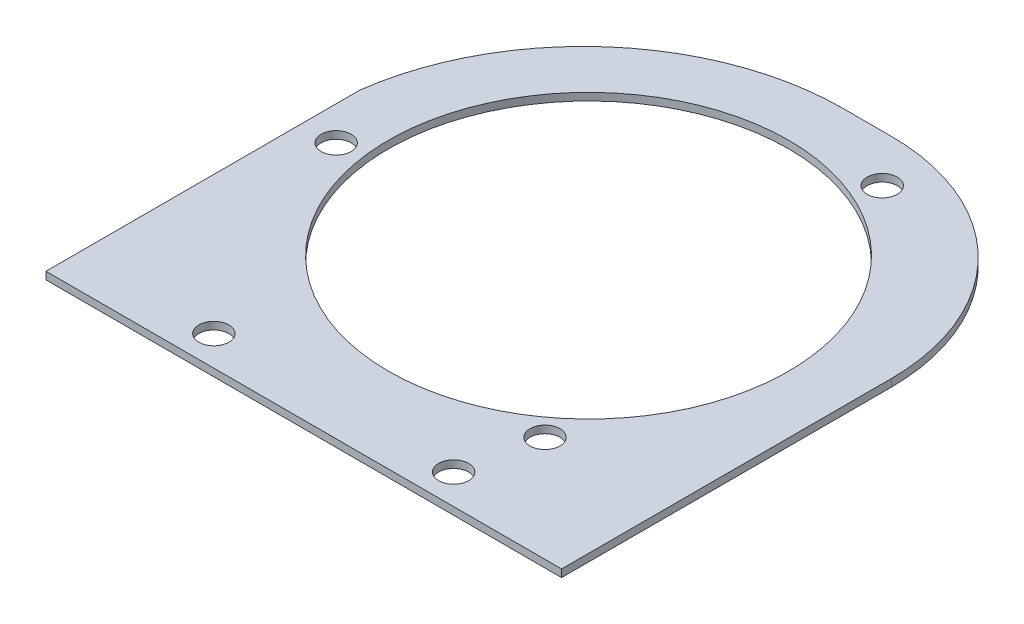
ISO-10303-21;
HEADER;
FILE_DESCRIPTION(('STEP AP214'),'2;1');
FILE_NAME('part.step','',(''),(''),'','','');
FILE_SCHEMA(('AUTOMOTIVE_DESIGN { 1 0 10303 214 1 1 1 1 }'));
ENDSEC;
DATA;
#1=APPLICATION_CONTEXT('core data for automotive mechanical design processes');
#2=APPLICATION_PROTOCOL_DEFINITION('international standard','automotive_design',2000,#1);
#3=PRODUCT_CONTEXT('',#1,'mechanical');
#4=PRODUCT('Part','Part','',(#3));
#5=PRODUCT_RELATED_PRODUCT_CATEGORY('part','',(#4));
#6=PRODUCT_DEFINITION_FORMATION('','',#4);
#7=PRODUCT_DEFINITION_CONTEXT('part definition',#1,'design');
#8=PRODUCT_DEFINITION('design','',#6,#7);
#9=PRODUCT_DEFINITION_SHAPE('','',#8);
#10=(LENGTH_UNIT() NAMED_UNIT(*) SI_UNIT(.MILLI.,.METRE.));
#11=(NAMED_UNIT(*) PLANE_ANGLE_UNIT() SI_UNIT($,.RADIAN.));
#12=(NAMED_UNIT(*) SI_UNIT($,.STERADIAN.) SOLID_ANGLE_UNIT());
#13=UNCERTAINTY_MEASURE_WITH_UNIT(LENGTH_MEASURE(1.E-05),#10,'distance_accuracy_value','');
#14=(GEOMETRIC_REPRESENTATION_CONTEXT(3) GLOBAL_UNCERTAINTY_ASSIGNED_CONTEXT((#13)) GLOBAL_UNIT_ASSIGNED_CONTEXT((#10,
#11,#12)) REPRESENTATION_CONTEXT('',''));
#15=CARTESIAN_POINT('',(0.,0.,0.));
#16=DIRECTION('',(0.,0.,1.));
#17=DIRECTION('',(1.,0.,0.));
#18=AXIS2_PLACEMENT_3D('',#15,#16,#17);
#19=CARTESIAN_POINT('',(16.7516707964213,3.175,-21.6657019962549));
#20=DIRECTION('',(0.,-1.,0.));
#21=DIRECTION('',(0.,0.,-1.));
#22=AXIS2_PLACEMENT_3D('',#19,#20,#21);
#23=PLANE('',#22);
#24=DIRECTION('',(0.,0.,1.));
#25=VECTOR('',#24,1.);
#26=CARTESIAN_POINT('',(-112.788329203579,3.175,-14.9421725844915));
#27=LINE('',#26,#25);
#28=CARTESIAN_POINT('',(-112.788329203579,3.175,-14.9421725844916));
#29=VERTEX_POINT('',#28);
#30=CARTESIAN_POINT('',(-112.788329203579,3.175,118.034298003745));
#31=VERTEX_POINT('',#30);
#32=EDGE_CURVE('E131',#29,#31,#27,.T.);
#33=ORIENTED_EDGE('',*,*,#32,.T.);
#34=DIRECTION('',(1.,0.,0.));
#35=VECTOR('',#34,1.);
#36=CARTESIAN_POINT('',(105.651670796421,3.175,118.034298003745));
#37=LINE('',#36,#35);
#38=CARTESIAN_POINT('',(105.651670796421,3.175,118.034298003745));
#39=VERTEX_POINT('',#38);
#40=EDGE_CURVE('E89',#31,#39,#37,.T.);
#41=ORIENTED_EDGE('',*,*,#40,.T.);
#42=DIRECTION('',(0.,0.,-1.));
#43=VECTOR('',#42,1.);
#44=CARTESIAN_POINT('',(105.651670796421,3.175,-21.6657019962549));
#45=LINE('',#44,#43);
#46=CARTESIAN_POINT('',(105.651670796421,3.175,-21.6657019962549));
#47=VERTEX_POINT('',#46);
#48=EDGE_CURVE('E102',#39,#47,#45,.T.);
#49=ORIENTED_EDGE('',*,*,#48,.T.);
#50=CARTESIAN_POINT('',(16.7516707964213,3.175,-21.6657019962549));
#51=DIRECTION('',(0.,1.,0.));
#52=DIRECTION('',(0.,0.,-1.));
#53=AXIS2_PLACEMENT_3D('',#50,#51,#52);
#54=CIRCLE('',#53,88.9);
#55=CARTESIAN_POINT('',(16.7516707964213,3.175,-110.565701996255));
#56=VERTEX_POINT('',#55);
#57=EDGE_CURVE('E96',#47,#56,#54,.T.);
#58=ORIENTED_EDGE('',*,*,#57,.T.);
#59=DIRECTION('',(-1.,0.,0.));
#60=VECTOR('',#59,1.);
#61=CARTESIAN_POINT('',(16.7516707964213,3.175,-110.565701996255));
#62=LINE('',#61,#60);
#63=CARTESIAN_POINT('',(-3.56832920357874,3.175,-110.565701996255));
#64=VERTEX_POINT('',#63);
#65=EDGE_CURVE('E100',#56,#64,#62,.T.);
#66=ORIENTED_EDGE('',*,*,#65,.T.);
#67=CARTESIAN_POINT('',(-3.56832920357873,3.175,-0.379077915372299));
#68=DIRECTION('',(0.,1.,0.));
#69=DIRECTION('',(0.,0.,1.));
#70=AXIS2_PLACEMENT_3D('',#67,#68,#69);
#71=CIRCLE('',#70,110.186624080883);
#72=EDGE_CURVE('E52',#64,#29,#71,.T.);
#73=ORIENTED_EDGE('',*,*,#72,.T.);
#74=EDGE_LOOP('',(#33,#41,#49,#58,#66,#73));
#75=FACE_BOUND('',#74,.T.);
#76=CARTESIAN_POINT('',(-3.56832920357873,3.175,-2.61570199625484));
#77=DIRECTION('',(0.,1.,0.));
#78=DIRECTION('',(0.,0.,1.));
#79=AXIS2_PLACEMENT_3D('',#76,#77,#78);
#80=CIRCLE('',#79,84.7725);
#81=CARTESIAN_POINT('',(-3.56832920357873,3.175,82.1567980037452));
#82=VERTEX_POINT('',#81);
#83=EDGE_CURVE('E124',#82,#82,#80,.T.);
#84=ORIENTED_EDGE('',*,*,#83,.F.);
#85=EDGE_LOOP('',(#84));
#86=FACE_BOUND('',#85,.T.);
#87=CARTESIAN_POINT('',(-98.4364962955683,3.175,9.45054506168119));
#88=DIRECTION('',(0.,1.,0.));
#89=DIRECTION('',(0.,0.,1.));
#90=AXIS2_PLACEMENT_3D('',#87,#88,#89);
#91=CIRCLE('',#90,6.35);
#92=CARTESIAN_POINT('',(-98.4364962955683,3.175,15.8005450616812));
#93=VERTEX_POINT('',#92);
#94=EDGE_CURVE('E215',#93,#93,#91,.T.);
#95=ORIENTED_EDGE('',*,*,#94,.F.);
#96=EDGE_LOOP('',(#95));
#97=FACE_BOUND('',#96,.T.);
#98=CARTESIAN_POINT('',(-54.3683292035787,3.175,105.334298003745));
#99=DIRECTION('',(0.,1.,0.));
#100=DIRECTION('',(0.,0.,1.));
#101=AXIS2_PLACEMENT_3D('',#98,#99,#100);
#102=CIRCLE('',#101,6.35);
#103=CARTESIAN_POINT('',(-54.3683292035787,3.175,111.684298003745));
#104=VERTEX_POINT('',#103);
#105=EDGE_CURVE('E209',#104,#104,#102,.T.);
#106=ORIENTED_EDGE('',*,*,#105,.F.);
#107=EDGE_LOOP('',(#106));
#108=FACE_BOUND('',#107,.T.);
#109=CARTESIAN_POINT('',(47.2316707964213,3.175,105.334298003745));
#110=DIRECTION('',(0.,1.,0.));
#111=DIRECTION('',(0.,0.,-1.));
#112=AXIS2_PLACEMENT_3D('',#109,#110,#111);
#113=CIRCLE('',#112,6.35);
#114=CARTESIAN_POINT('',(47.2316707964213,3.175,98.9842980037452));
#115=VERTEX_POINT('',#114);
#116=EDGE_CURVE('E203',#115,#115,#113,.T.);
#117=ORIENTED_EDGE('',*,*,#116,.F.);
#118=EDGE_LOOP('',(#117));
#119=FACE_BOUND('',#118,.T.);
#120=CARTESIAN_POINT('',(32.9548211037861,3.175,-90.5211094813046));
#121=DIRECTION('',(0.,1.,0.));
#122=DIRECTION('',(0.,0.,1.));
#123=AXIS2_PLACEMENT_3D('',#120,#121,#122);
#124=CIRCLE('',#123,6.34999999999999);
#125=CARTESIAN_POINT('',(32.9548211037861,3.175,-84.1711094813047));
#126=VERTEX_POINT('',#125);
#127=EDGE_CURVE('E197',#126,#126,#124,.T.);
#128=ORIENTED_EDGE('',*,*,#127,.F.);
#129=EDGE_LOOP('',(#128));
#130=FACE_BOUND('',#129,.T.);
#131=CARTESIAN_POINT('',(53.8371548966967,3.175,73.2529364947335));
#132=DIRECTION('',(0.,1.,0.));
#133=DIRECTION('',(0.,0.,1.));
#134=AXIS2_PLACEMENT_3D('',#131,#132,#133);
#135=CIRCLE('',#134,6.35000000000002);
#136=CARTESIAN_POINT('',(53.8371548966967,3.175,79.6029364947336));
#137=VERTEX_POINT('',#136);
#138=EDGE_CURVE('E188',#137,#137,#135,.T.);
#139=ORIENTED_EDGE('',*,*,#138,.F.);
#140=EDGE_LOOP('',(#139));
#141=FACE_BOUND('',#140,.T.);
#142=ADVANCED_FACE('F35',(#75,#86,#97,#108,#119,#130,#141),#23,.F.);
#143=CARTESIAN_POINT('',(16.7516707964213,0.,-21.6657019962549));
#144=DIRECTION('',(0.,-1.,0.));
#145=DIRECTION('',(0.,0.,-1.));
#146=AXIS2_PLACEMENT_3D('',#143,#144,#145);
#147=PLANE('',#146);
#148=CARTESIAN_POINT('',(32.9548211037861,0.,-90.5211094813046));
#149=DIRECTION('',(0.,1.,0.));
#150=DIRECTION('',(0.,0.,1.));
#151=AXIS2_PLACEMENT_3D('',#148,#149,#150);
#152=CIRCLE('',#151,6.34999999999999);
#153=CARTESIAN_POINT('',(32.9548211037861,0.,-84.1711094813047));
#154=VERTEX_POINT('',#153);
#155=EDGE_CURVE('E194',#154,#154,#152,.T.);
#156=ORIENTED_EDGE('',*,*,#155,.T.);
#157=EDGE_LOOP('',(#156));
#158=FACE_BOUND('',#157,.T.);
#159=CARTESIAN_POINT('',(-54.3683292035787,0.,105.334298003745));
#160=DIRECTION('',(0.,1.,0.));
#161=DIRECTION('',(0.,0.,1.));
#162=AXIS2_PLACEMENT_3D('',#159,#160,#161);
#163=CIRCLE('',#162,6.35);
#164=CARTESIAN_POINT('',(-54.3683292035787,0.,111.684298003745));
#165=VERTEX_POINT('',#164);
#166=EDGE_CURVE('E206',#165,#165,#163,.T.);
#167=ORIENTED_EDGE('',*,*,#166,.T.);
#168=EDGE_LOOP('',(#167));
#169=FACE_BOUND('',#168,.T.);
#170=CARTESIAN_POINT('',(-3.56832920357873,0.,-2.61570199625484));
#171=DIRECTION('',(0.,1.,0.));
#172=DIRECTION('',(0.,0.,1.));
#173=AXIS2_PLACEMENT_3D('',#170,#171,#172);
#174=CIRCLE('',#173,84.7725);
#175=CARTESIAN_POINT('',(-3.56832920357873,0.,82.1567980037452));
#176=VERTEX_POINT('',#175);
#177=EDGE_CURVE('E218',#176,#176,#174,.T.);
#178=ORIENTED_EDGE('',*,*,#177,.T.);
#179=EDGE_LOOP('',(#178));
#180=FACE_BOUND('',#179,.T.);
#181=DIRECTION('',(0.,0.,1.));
#182=VECTOR('',#181,1.);
#183=CARTESIAN_POINT('',(-112.788329203579,0.,-14.9421725844915));
#184=LINE('',#183,#182);
#185=CARTESIAN_POINT('',(-112.788329203579,0.,-14.9421725844916));
#186=VERTEX_POINT('',#185);
#187=CARTESIAN_POINT('',(-112.788329203579,0.,118.034298003745));
#188=VERTEX_POINT('',#187);
#189=EDGE_CURVE('E120',#186,#188,#184,.T.);
#190=ORIENTED_EDGE('',*,*,#189,.F.);
#191=CARTESIAN_POINT('',(-3.56832920357873,0.,-0.379077915372299));
#192=DIRECTION('',(0.,1.,0.));
#193=DIRECTION('',(0.,0.,1.));
#194=AXIS2_PLACEMENT_3D('',#191,#192,#193);
#195=CIRCLE('',#194,110.186624080883);
#196=CARTESIAN_POINT('',(-3.56832920357874,0.,-110.565701996255));
#197=VERTEX_POINT('',#196);
#198=EDGE_CURVE('E81',#197,#186,#195,.T.);
#199=ORIENTED_EDGE('',*,*,#198,.F.);
#200=DIRECTION('',(-1.,0.,0.));
#201=VECTOR('',#200,1.);
#202=CARTESIAN_POINT('',(16.7516707964213,0.,-110.565701996255));
#203=LINE('',#202,#201);
#204=CARTESIAN_POINT('',(16.7516707964213,0.,-110.565701996255));
#205=VERTEX_POINT('',#204);
#206=EDGE_CURVE('E75',#205,#197,#203,.T.);
#207=ORIENTED_EDGE('',*,*,#206,.F.);
#208=CARTESIAN_POINT('',(16.7516707964213,0.,-21.6657019962549));
#209=DIRECTION('',(0.,1.,0.));
#210=DIRECTION('',(0.,0.,-1.));
#211=AXIS2_PLACEMENT_3D('',#208,#209,#210);
#212=CIRCLE('',#211,88.9);
#213=CARTESIAN_POINT('',(105.651670796421,0.,-21.6657019962549));
#214=VERTEX_POINT('',#213);
#215=EDGE_CURVE('E110',#214,#205,#212,.T.);
#216=ORIENTED_EDGE('',*,*,#215,.F.);
#217=DIRECTION('',(0.,0.,-1.));
#218=VECTOR('',#217,1.);
#219=CARTESIAN_POINT('',(105.651670796421,0.,-21.6657019962549));
#220=LINE('',#219,#218);
#221=CARTESIAN_POINT('',(105.651670796421,0.,118.034298003745));
#222=VERTEX_POINT('',#221);
#223=EDGE_CURVE('E126',#222,#214,#220,.T.);
#224=ORIENTED_EDGE('',*,*,#223,.F.);
#225=DIRECTION('',(1.,0.,0.));
#226=VECTOR('',#225,1.);
#227=CARTESIAN_POINT('',(105.651670796421,0.,118.034298003745));
#228=LINE('',#227,#226);
#229=EDGE_CURVE('E123',#188,#222,#228,.T.);
#230=ORIENTED_EDGE('',*,*,#229,.F.);
#231=EDGE_LOOP('',(#190,#199,#207,#216,#224,#230));
#232=FACE_BOUND('',#231,.T.);
#233=CARTESIAN_POINT('',(-98.4364962955683,0.,9.45054506168119));
#234=DIRECTION('',(0.,1.,0.));
#235=DIRECTION('',(0.,0.,1.));
#236=AXIS2_PLACEMENT_3D('',#233,#234,#235);
#237=CIRCLE('',#236,6.35);
#238=CARTESIAN_POINT('',(-98.4364962955683,0.,15.8005450616812));
#239=VERTEX_POINT('',#238);
#240=EDGE_CURVE('E212',#239,#239,#237,.T.);
#241=ORIENTED_EDGE('',*,*,#240,.T.);
#242=EDGE_LOOP('',(#241));
#243=FACE_BOUND('',#242,.T.);
#244=CARTESIAN_POINT('',(47.2316707964213,0.,105.334298003745));
#245=DIRECTION('',(0.,1.,0.));
#246=DIRECTION('',(0.,0.,-1.));
#247=AXIS2_PLACEMENT_3D('',#244,#245,#246);
#248=CIRCLE('',#247,6.35);
#249=CARTESIAN_POINT('',(47.2316707964213,0.,98.9842980037452));
#250=VERTEX_POINT('',#249);
#251=EDGE_CURVE('E200',#250,#250,#248,.T.);
#252=ORIENTED_EDGE('',*,*,#251,.T.);
#253=EDGE_LOOP('',(#252));
#254=FACE_BOUND('',#253,.T.);
#255=CARTESIAN_POINT('',(53.8371548966967,0.,73.2529364947335));
#256=DIRECTION('',(0.,1.,0.));
#257=DIRECTION('',(0.,0.,1.));
#258=AXIS2_PLACEMENT_3D('',#255,#256,#257);
#259=CIRCLE('',#258,6.35000000000002);
#260=CARTESIAN_POINT('',(53.8371548966967,0.,79.6029364947336));
#261=VERTEX_POINT('',#260);
#262=EDGE_CURVE('E191',#261,#261,#259,.T.);
#263=ORIENTED_EDGE('',*,*,#262,.T.);
#264=EDGE_LOOP('',(#263));
#265=FACE_BOUND('',#264,.T.);
#266=ADVANCED_FACE('F140',(#158,#169,#180,#232,#243,#254,#265),#147,.T.);
#267=CARTESIAN_POINT('',(-112.788329203579,3.175,-14.9421725844915));
#268=DIRECTION('',(1.,0.,0.));
#269=DIRECTION('',(0.,0.,-1.));
#270=AXIS2_PLACEMENT_3D('',#267,#268,#269);
#271=PLANE('',#270);
#272=ORIENTED_EDGE('',*,*,#189,.T.);
#273=DIRECTION('',(0.,-1.,0.));
#274=VECTOR('',#273,1.);
#275=CARTESIAN_POINT('',(-112.788329203579,3.175,118.034298003745));
#276=LINE('',#275,#274);
#277=EDGE_CURVE('E11',#31,#188,#276,.T.);
#278=ORIENTED_EDGE('',*,*,#277,.F.);
#279=ORIENTED_EDGE('',*,*,#32,.F.);
#280=DIRECTION('',(0.,-1.,0.));
#281=VECTOR('',#280,1.);
#282=CARTESIAN_POINT('',(-112.788329203579,3.175,-14.9421725844916));
#283=LINE('',#282,#281);
#284=EDGE_CURVE('E116',#29,#186,#283,.T.);
#285=ORIENTED_EDGE('',*,*,#284,.T.);
#286=EDGE_LOOP('',(#272,#278,#279,#285));
#287=FACE_BOUND('',#286,.T.);
#288=ADVANCED_FACE('F37',(#287),#271,.F.);
#289=CARTESIAN_POINT('',(105.651670796421,3.175,118.034298003745));
#290=DIRECTION('',(0.,0.,-1.));
#291=DIRECTION('',(-1.,0.,0.));
#292=AXIS2_PLACEMENT_3D('',#289,#290,#291);
#293=PLANE('',#292);
#294=ORIENTED_EDGE('',*,*,#229,.T.);
#295=DIRECTION('',(0.,-1.,0.));
#296=VECTOR('',#295,1.);
#297=CARTESIAN_POINT('',(105.651670796421,3.175,118.034298003745));
#298=LINE('',#297,#296);
#299=EDGE_CURVE('E44',#39,#222,#298,.T.);
#300=ORIENTED_EDGE('',*,*,#299,.F.);
#301=ORIENTED_EDGE('',*,*,#40,.F.);
#302=ORIENTED_EDGE('',*,*,#277,.T.);
#303=EDGE_LOOP('',(#294,#300,#301,#302));
#304=FACE_BOUND('',#303,.T.);
#305=ADVANCED_FACE('F296',(#304),#293,.F.);
#306=CARTESIAN_POINT('',(105.651670796421,3.175,-21.6657019962549));
#307=DIRECTION('',(-1.,0.,0.));
#308=DIRECTION('',(0.,0.,1.));
#309=AXIS2_PLACEMENT_3D('',#306,#307,#308);
#310=PLANE('',#309);
#311=ORIENTED_EDGE('',*,*,#223,.T.);
#312=DIRECTION('',(0.,-1.,0.));
#313=VECTOR('',#312,1.);
#314=CARTESIAN_POINT('',(105.651670796421,3.175,-21.6657019962549));
#315=LINE('',#314,#313);
#316=EDGE_CURVE('E111',#47,#214,#315,.T.);
#317=ORIENTED_EDGE('',*,*,#316,.F.);
#318=ORIENTED_EDGE('',*,*,#48,.F.);
#319=ORIENTED_EDGE('',*,*,#299,.T.);
#320=EDGE_LOOP('',(#311,#317,#318,#319));
#321=FACE_BOUND('',#320,.T.);
#322=ADVANCED_FACE('F137',(#321),#310,.F.);
#323=CARTESIAN_POINT('',(16.7516707964213,3.175,-21.6657019962549));
#324=DIRECTION('',(0.,-1.,0.));
#325=DIRECTION('',(0.,0.,-1.));
#326=AXIS2_PLACEMENT_3D('',#323,#324,#325);
#327=CYLINDRICAL_SURFACE('',#326,88.9);
#328=ORIENTED_EDGE('',*,*,#215,.T.);
#329=DIRECTION('',(0.,-1.,0.));
#330=VECTOR('',#329,1.);
#331=CARTESIAN_POINT('',(16.7516707964213,3.175,-110.565701996255));
#332=LINE('',#331,#330);
#333=EDGE_CURVE('E107',#56,#205,#332,.T.);
#334=ORIENTED_EDGE('',*,*,#333,.F.);
#335=ORIENTED_EDGE('',*,*,#57,.F.);
#336=ORIENTED_EDGE('',*,*,#316,.T.);
#337=EDGE_LOOP('',(#328,#334,#335,#336));
#338=FACE_BOUND('',#337,.T.);
#339=ADVANCED_FACE('F108',(#338),#327,.T.);
#340=CARTESIAN_POINT('',(16.7516707964213,3.175,-110.565701996255));
#341=DIRECTION('',(0.,0.,1.));
#342=DIRECTION('',(1.,0.,0.));
#343=AXIS2_PLACEMENT_3D('',#340,#341,#342);
#344=PLANE('',#343);
#345=ORIENTED_EDGE('',*,*,#206,.T.);
#346=DIRECTION('',(0.,-1.,0.));
#347=VECTOR('',#346,1.);
#348=CARTESIAN_POINT('',(-3.56832920357874,3.175,-110.565701996255));
#349=LINE('',#348,#347);
#350=EDGE_CURVE('E112',#64,#197,#349,.T.);
#351=ORIENTED_EDGE('',*,*,#350,.F.);
#352=ORIENTED_EDGE('',*,*,#65,.F.);
#353=ORIENTED_EDGE('',*,*,#333,.T.);
#354=EDGE_LOOP('',(#345,#351,#352,#353));
#355=FACE_BOUND('',#354,.T.);
#356=ADVANCED_FACE('F114',(#355),#344,.F.);
#357=CARTESIAN_POINT('',(-3.56832920357873,3.175,-0.379077915372299));
#358=DIRECTION('',(0.,-1.,0.));
#359=DIRECTION('',(0.,0.,-1.));
#360=AXIS2_PLACEMENT_3D('',#357,#358,#359);
#361=CYLINDRICAL_SURFACE('',#360,110.186624080883);
#362=ORIENTED_EDGE('',*,*,#198,.T.);
#363=ORIENTED_EDGE('',*,*,#284,.F.);
#364=ORIENTED_EDGE('',*,*,#72,.F.);
#365=ORIENTED_EDGE('',*,*,#350,.T.);
#366=EDGE_LOOP('',(#362,#363,#364,#365));
#367=FACE_BOUND('',#366,.T.);
#368=ADVANCED_FACE('F145',(#367),#361,.T.);
#369=CARTESIAN_POINT('',(-3.56832920357873,3.175,-2.61570199625484));
#370=DIRECTION('',(0.,-1.,0.));
#371=DIRECTION('',(0.,0.,-1.));
#372=AXIS2_PLACEMENT_3D('',#369,#370,#371);
#373=CYLINDRICAL_SURFACE('',#372,84.7725);
#374=ORIENTED_EDGE('',*,*,#83,.T.);
#375=EDGE_LOOP('',(#374));
#376=FACE_BOUND('',#375,.T.);
#377=ORIENTED_EDGE('',*,*,#177,.F.);
#378=EDGE_LOOP('',(#377));
#379=FACE_BOUND('',#378,.T.);
#380=ADVANCED_FACE('F147',(#376,#379),#373,.F.);
#381=CARTESIAN_POINT('',(-98.4364962955683,3.175,9.45054506168119));
#382=DIRECTION('',(0.,-1.,0.));
#383=DIRECTION('',(0.,0.,-1.));
#384=AXIS2_PLACEMENT_3D('',#381,#382,#383);
#385=CYLINDRICAL_SURFACE('',#384,6.35);
#386=ORIENTED_EDGE('',*,*,#94,.T.);
#387=EDGE_LOOP('',(#386));
#388=FACE_BOUND('',#387,.T.);
#389=ORIENTED_EDGE('',*,*,#240,.F.);
#390=EDGE_LOOP('',(#389));
#391=FACE_BOUND('',#390,.T.);
#392=ADVANCED_FACE('F153',(#388,#391),#385,.F.);
#393=CARTESIAN_POINT('',(-54.3683292035787,3.175,105.334298003745));
#394=DIRECTION('',(0.,-1.,0.));
#395=DIRECTION('',(0.,0.,-1.));
#396=AXIS2_PLACEMENT_3D('',#393,#394,#395);
#397=CYLINDRICAL_SURFACE('',#396,6.35);
#398=ORIENTED_EDGE('',*,*,#105,.T.);
#399=EDGE_LOOP('',(#398));
#400=FACE_BOUND('',#399,.T.);
#401=ORIENTED_EDGE('',*,*,#166,.F.);
#402=EDGE_LOOP('',(#401));
#403=FACE_BOUND('',#402,.T.);
#404=ADVANCED_FACE('F167',(#400,#403),#397,.F.);
#405=CARTESIAN_POINT('',(47.2316707964213,3.175,105.334298003745));
#406=DIRECTION('',(0.,-1.,0.));
#407=DIRECTION('',(0.,0.,-1.));
#408=AXIS2_PLACEMENT_3D('',#405,#406,#407);
#409=CYLINDRICAL_SURFACE('',#408,6.35);
#410=ORIENTED_EDGE('',*,*,#116,.T.);
#411=EDGE_LOOP('',(#410));
#412=FACE_BOUND('',#411,.T.);
#413=ORIENTED_EDGE('',*,*,#251,.F.);
#414=EDGE_LOOP('',(#413));
#415=FACE_BOUND('',#414,.T.);
#416=ADVANCED_FACE('F171',(#412,#415),#409,.F.);
#417=CARTESIAN_POINT('',(32.9548211037861,3.175,-90.5211094813046));
#418=DIRECTION('',(0.,-1.,0.));
#419=DIRECTION('',(0.,0.,-1.));
#420=AXIS2_PLACEMENT_3D('',#417,#418,#419);
#421=CYLINDRICAL_SURFACE('',#420,6.34999999999999);
#422=ORIENTED_EDGE('',*,*,#127,.T.);
#423=EDGE_LOOP('',(#422));
#424=FACE_BOUND('',#423,.T.);
#425=ORIENTED_EDGE('',*,*,#155,.F.);
#426=EDGE_LOOP('',(#425));
#427=FACE_BOUND('',#426,.T.);
#428=ADVANCED_FACE('F175',(#424,#427),#421,.F.);
#429=CARTESIAN_POINT('',(53.8371548966967,3.175,73.2529364947335));
#430=DIRECTION('',(0.,-1.,0.));
#431=DIRECTION('',(0.,0.,-1.));
#432=AXIS2_PLACEMENT_3D('',#429,#430,#431);
#433=CYLINDRICAL_SURFACE('',#432,6.35000000000002);
#434=ORIENTED_EDGE('',*,*,#138,.T.);
#435=EDGE_LOOP('',(#434));
#436=FACE_BOUND('',#435,.T.);
#437=ORIENTED_EDGE('',*,*,#262,.F.);
#438=EDGE_LOOP('',(#437));
#439=FACE_BOUND('',#438,.T.);
#440=ADVANCED_FACE('F179',(#436,#439),#433,.F.);
#441=CLOSED_SHELL('',(#142,#266,#288,#305,#322,#339,#356,#368,#380,#392,#404,#416,#428,#440));
#442=MANIFOLD_SOLID_BREP('B2',#441);
#443=ADVANCED_BREP_SHAPE_REPRESENTATION('',(#18,#442),#14);
#444=SHAPE_DEFINITION_REPRESENTATION(#9,#443);
ENDSEC;
END-ISO-10303-21;
